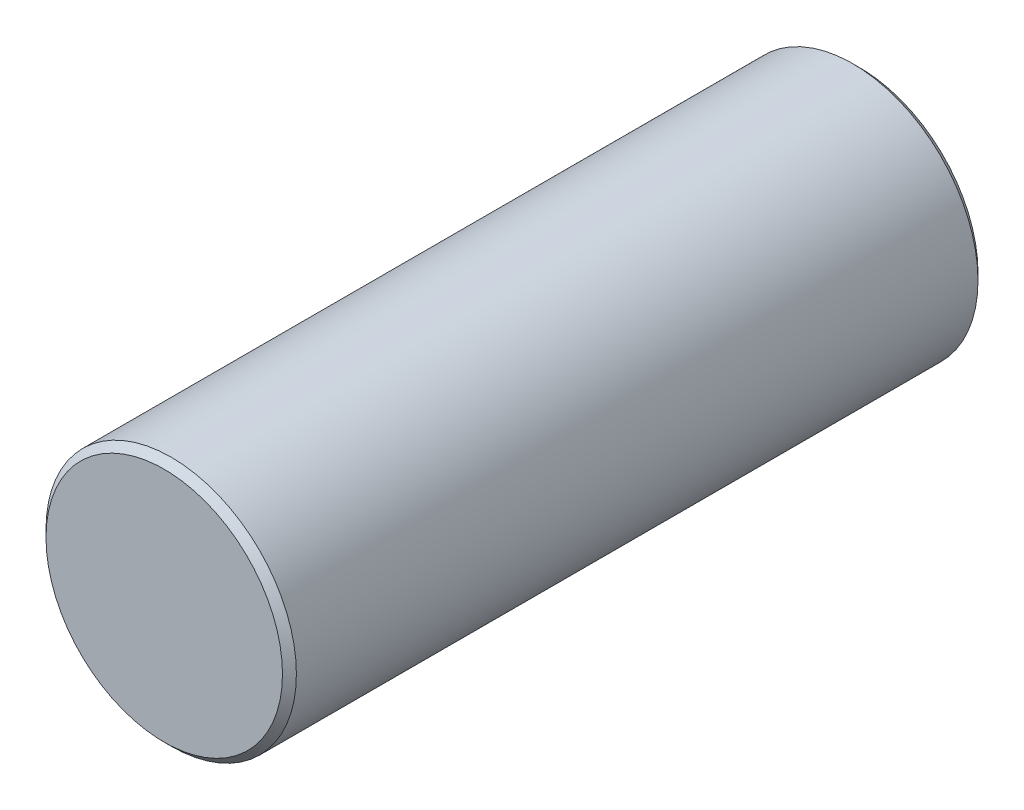
ISO-10303-21;
HEADER;
FILE_DESCRIPTION(('STEP AP214'),'2;1');
FILE_NAME('part.step','',(''),(''),'','','');
FILE_SCHEMA(('AUTOMOTIVE_DESIGN { 1 0 10303 214 1 1 1 1 }'));
ENDSEC;
DATA;
#1=APPLICATION_CONTEXT('core data for automotive mechanical design processes');
#2=APPLICATION_PROTOCOL_DEFINITION('international standard','automotive_design',2000,#1);
#3=PRODUCT_CONTEXT('',#1,'mechanical');
#4=PRODUCT('Part','Part','',(#3));
#5=PRODUCT_RELATED_PRODUCT_CATEGORY('part','',(#4));
#6=PRODUCT_DEFINITION_FORMATION('','',#4);
#7=PRODUCT_DEFINITION_CONTEXT('part definition',#1,'design');
#8=PRODUCT_DEFINITION('design','',#6,#7);
#9=PRODUCT_DEFINITION_SHAPE('','',#8);
#10=(LENGTH_UNIT() NAMED_UNIT(*) SI_UNIT(.MILLI.,.METRE.));
#11=(NAMED_UNIT(*) PLANE_ANGLE_UNIT() SI_UNIT($,.RADIAN.));
#12=(NAMED_UNIT(*) SI_UNIT($,.STERADIAN.) SOLID_ANGLE_UNIT());
#13=UNCERTAINTY_MEASURE_WITH_UNIT(LENGTH_MEASURE(1.E-05),#10,'distance_accuracy_value','');
#14=(GEOMETRIC_REPRESENTATION_CONTEXT(3) GLOBAL_UNCERTAINTY_ASSIGNED_CONTEXT((#13)) GLOBAL_UNIT_ASSIGNED_CONTEXT((#10,
#11,#12)) REPRESENTATION_CONTEXT('',''));
#15=CARTESIAN_POINT('',(0.,0.,0.));
#16=DIRECTION('',(0.,0.,1.));
#17=DIRECTION('',(1.,0.,0.));
#18=AXIS2_PLACEMENT_3D('',#15,#16,#17);
#19=CARTESIAN_POINT('',(0.,8.99999999999999,0.));
#20=DIRECTION('',(0.,0.,-1.));
#21=DIRECTION('',(-1.,0.,0.));
#22=AXIS2_PLACEMENT_3D('',#19,#20,#21);
#23=PLANE('',#22);
#24=CARTESIAN_POINT('',(0.,0.,0.));
#25=DIRECTION('',(0.,0.,-1.));
#26=DIRECTION('',(-1.,0.,0.));
#27=AXIS2_PLACEMENT_3D('',#24,#25,#26);
#28=CIRCLE('',#27,8.49999999999996);
#29=CARTESIAN_POINT('',(-8.49999999999996,0.,0.));
#30=VERTEX_POINT('',#29);
#31=EDGE_CURVE('E95',#30,#30,#28,.F.);
#32=ORIENTED_EDGE('',*,*,#31,.T.);
#33=EDGE_LOOP('',(#32));
#34=FACE_BOUND('',#33,.T.);
#35=ADVANCED_FACE('F35',(#34),#23,.F.);
#36=CARTESIAN_POINT('',(0.,0.,-35.));
#37=DIRECTION('',(0.,0.,-1.));
#38=DIRECTION('',(-1.,0.,0.));
#39=AXIS2_PLACEMENT_3D('',#36,#37,#38);
#40=CONICAL_SURFACE('',#39,0.,0.785398163397446);
#41=CARTESIAN_POINT('',(0.,0.,-38.));
#42=DIRECTION('',(0.,0.,1.));
#43=DIRECTION('',(1.,0.,0.));
#44=AXIS2_PLACEMENT_3D('',#41,#42,#43);
#45=CIRCLE('',#44,3.);
#46=CARTESIAN_POINT('',(3.,0.,-38.));
#47=VERTEX_POINT('',#46);
#48=EDGE_CURVE('E98',#47,#47,#45,.T.);
#49=ORIENTED_EDGE('',*,*,#48,.F.);
#50=EDGE_LOOP('',(#49));
#51=FACE_BOUND('',#50,.T.);
#52=CARTESIAN_POINT('',(0.,0.,-35.));
#53=VERTEX_POINT('',#52);
#54=VERTEX_LOOP('',#53);
#55=FACE_BOUND('',#54,.T.);
#56=ADVANCED_FACE('F46',(#51,#55),#40,.F.);
#57=CARTESIAN_POINT('',(0.,0.,494.673459935156));
#58=DIRECTION('',(0.,0.,1.));
#59=DIRECTION('',(1.,0.,0.));
#60=AXIS2_PLACEMENT_3D('',#57,#58,#59);
#61=CYLINDRICAL_SURFACE('',#60,3.);
#62=CARTESIAN_POINT('',(0.,0.,-49.5));
#63=DIRECTION('',(0.,0.,1.));
#64=DIRECTION('',(1.,0.,0.));
#65=AXIS2_PLACEMENT_3D('',#62,#63,#64);
#66=CIRCLE('',#65,3.);
#67=CARTESIAN_POINT('',(3.,0.,-49.5));
#68=VERTEX_POINT('',#67);
#69=EDGE_CURVE('E11',#68,#68,#66,.F.);
#70=ORIENTED_EDGE('',*,*,#69,.T.);
#71=EDGE_LOOP('',(#70));
#72=FACE_BOUND('',#71,.T.);
#73=ORIENTED_EDGE('',*,*,#48,.T.);
#74=EDGE_LOOP('',(#73));
#75=FACE_BOUND('',#74,.T.);
#76=ADVANCED_FACE('F48',(#72,#75),#61,.F.);
#77=CARTESIAN_POINT('',(0.,3.,-50.));
#78=DIRECTION('',(0.,0.,1.));
#79=DIRECTION('',(1.,0.,0.));
#80=AXIS2_PLACEMENT_3D('',#77,#78,#79);
#81=PLANE('',#80);
#82=CARTESIAN_POINT('',(0.,0.,-50.));
#83=DIRECTION('',(0.,0.,1.));
#84=DIRECTION('',(1.,0.,0.));
#85=AXIS2_PLACEMENT_3D('',#82,#83,#84);
#86=CIRCLE('',#85,3.49999999999994);
#87=CARTESIAN_POINT('',(3.49999999999994,0.,-50.));
#88=VERTEX_POINT('',#87);
#89=EDGE_CURVE('E43',#88,#88,#86,.T.);
#90=ORIENTED_EDGE('',*,*,#89,.T.);
#91=EDGE_LOOP('',(#90));
#92=FACE_BOUND('',#91,.T.);
#93=CARTESIAN_POINT('',(0.,0.,-50.));
#94=DIRECTION('',(0.,0.,1.));
#95=DIRECTION('',(1.,0.,0.));
#96=AXIS2_PLACEMENT_3D('',#93,#94,#95);
#97=CIRCLE('',#96,8.50000000000008);
#98=CARTESIAN_POINT('',(8.50000000000008,0.,-50.));
#99=VERTEX_POINT('',#98);
#100=EDGE_CURVE('E85',#99,#99,#97,.F.);
#101=ORIENTED_EDGE('',*,*,#100,.T.);
#102=EDGE_LOOP('',(#101));
#103=FACE_BOUND('',#102,.T.);
#104=ADVANCED_FACE('F55',(#92,#103),#81,.F.);
#105=CARTESIAN_POINT('',(0.,0.,494.673459935156));
#106=DIRECTION('',(0.,0.,1.));
#107=DIRECTION('',(1.,0.,0.));
#108=AXIS2_PLACEMENT_3D('',#105,#106,#107);
#109=CYLINDRICAL_SURFACE('',#108,9.);
#110=CARTESIAN_POINT('',(0.,0.,-0.500000000000056));
#111=DIRECTION('',(0.,0.,-1.));
#112=DIRECTION('',(-1.,0.,0.));
#113=AXIS2_PLACEMENT_3D('',#110,#111,#112);
#114=CIRCLE('',#113,9.);
#115=CARTESIAN_POINT('',(-9.,0.,-0.500000000000056));
#116=VERTEX_POINT('',#115);
#117=EDGE_CURVE('E87',#116,#116,#114,.T.);
#118=ORIENTED_EDGE('',*,*,#117,.T.);
#119=EDGE_LOOP('',(#118));
#120=FACE_BOUND('',#119,.T.);
#121=CARTESIAN_POINT('',(0.,0.,-49.5));
#122=DIRECTION('',(0.,0.,1.));
#123=DIRECTION('',(1.,0.,0.));
#124=AXIS2_PLACEMENT_3D('',#121,#122,#123);
#125=CIRCLE('',#124,9.);
#126=CARTESIAN_POINT('',(9.,0.,-49.5));
#127=VERTEX_POINT('',#126);
#128=EDGE_CURVE('E92',#127,#127,#125,.T.);
#129=ORIENTED_EDGE('',*,*,#128,.T.);
#130=EDGE_LOOP('',(#129));
#131=FACE_BOUND('',#130,.T.);
#132=ADVANCED_FACE('F70',(#120,#131),#109,.T.);
#133=CARTESIAN_POINT('',(0.,0.,0.));
#134=DIRECTION('',(0.,0.,-1.));
#135=DIRECTION('',(-1.,0.,0.));
#136=AXIS2_PLACEMENT_3D('',#133,#134,#135);
#137=CONICAL_SURFACE('',#136,8.49999999999996,0.785398163397431);
#138=ORIENTED_EDGE('',*,*,#117,.F.);
#139=EDGE_LOOP('',(#138));
#140=FACE_BOUND('',#139,.T.);
#141=ORIENTED_EDGE('',*,*,#31,.F.);
#142=EDGE_LOOP('',(#141));
#143=FACE_BOUND('',#142,.T.);
#144=ADVANCED_FACE('F64',(#140,#143),#137,.T.);
#145=CARTESIAN_POINT('',(0.,0.,-50.));
#146=DIRECTION('',(0.,0.,-1.));
#147=DIRECTION('',(-1.,0.,0.));
#148=AXIS2_PLACEMENT_3D('',#145,#146,#147);
#149=CONICAL_SURFACE('',#148,3.49999999999998,0.785398163397374);
#150=ORIENTED_EDGE('',*,*,#69,.F.);
#151=EDGE_LOOP('',(#150));
#152=FACE_BOUND('',#151,.T.);
#153=ORIENTED_EDGE('',*,*,#89,.F.);
#154=EDGE_LOOP('',(#153));
#155=FACE_BOUND('',#154,.T.);
#156=ADVANCED_FACE('F69',(#152,#155),#149,.F.);
#157=CARTESIAN_POINT('',(0.,0.,-49.5));
#158=DIRECTION('',(0.,0.,1.));
#159=DIRECTION('',(1.,0.,0.));
#160=AXIS2_PLACEMENT_3D('',#157,#158,#159);
#161=CONICAL_SURFACE('',#160,9.,0.785398163397348);
#162=ORIENTED_EDGE('',*,*,#100,.F.);
#163=EDGE_LOOP('',(#162));
#164=FACE_BOUND('',#163,.T.);
#165=ORIENTED_EDGE('',*,*,#128,.F.);
#166=EDGE_LOOP('',(#165));
#167=FACE_BOUND('',#166,.T.);
#168=ADVANCED_FACE('F38',(#164,#167),#161,.T.);
#169=CLOSED_SHELL('',(#35,#56,#76,#104,#132,#144,#156,#168));
#170=MANIFOLD_SOLID_BREP('B2',#169);
#171=ADVANCED_BREP_SHAPE_REPRESENTATION('',(#18,#170),#14);
#172=SHAPE_DEFINITION_REPRESENTATION(#9,#171);
ENDSEC;
END-ISO-10303-21;
